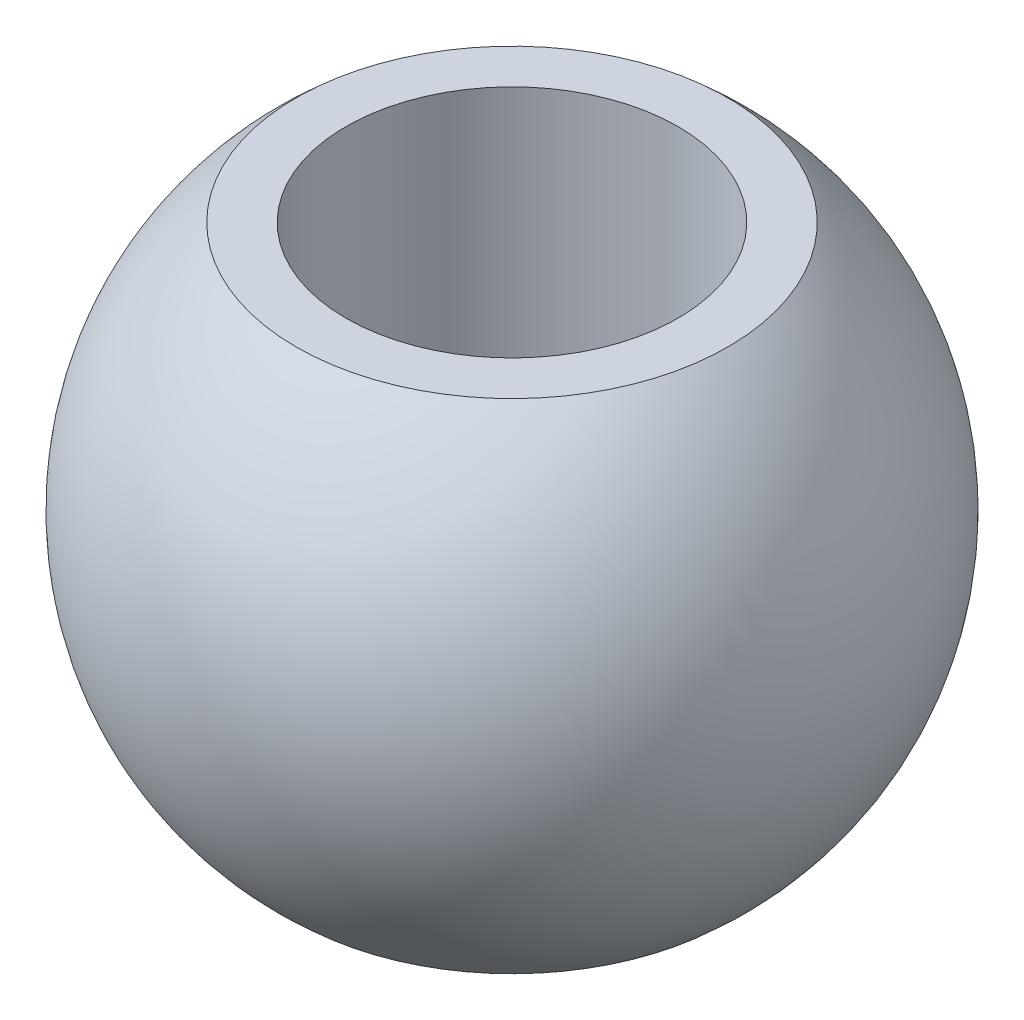
ISO-10303-21;
HEADER;
FILE_DESCRIPTION(('STEP AP214'),'2;1');
FILE_NAME('part.step','',(''),(''),'','','');
FILE_SCHEMA(('AUTOMOTIVE_DESIGN { 1 0 10303 214 1 1 1 1 }'));
ENDSEC;
DATA;
#1=APPLICATION_CONTEXT('core data for automotive mechanical design processes');
#2=APPLICATION_PROTOCOL_DEFINITION('international standard','automotive_design',2000,#1);
#3=PRODUCT_CONTEXT('',#1,'mechanical');
#4=PRODUCT('Part','Part','',(#3));
#5=PRODUCT_RELATED_PRODUCT_CATEGORY('part','',(#4));
#6=PRODUCT_DEFINITION_FORMATION('','',#4);
#7=PRODUCT_DEFINITION_CONTEXT('part definition',#1,'design');
#8=PRODUCT_DEFINITION('design','',#6,#7);
#9=PRODUCT_DEFINITION_SHAPE('','',#8);
#10=(LENGTH_UNIT() NAMED_UNIT(*) SI_UNIT(.MILLI.,.METRE.));
#11=(NAMED_UNIT(*) PLANE_ANGLE_UNIT() SI_UNIT($,.RADIAN.));
#12=(NAMED_UNIT(*) SI_UNIT($,.STERADIAN.) SOLID_ANGLE_UNIT());
#13=UNCERTAINTY_MEASURE_WITH_UNIT(LENGTH_MEASURE(1.E-05),#10,'distance_accuracy_value','');
#14=(GEOMETRIC_REPRESENTATION_CONTEXT(3) GLOBAL_UNCERTAINTY_ASSIGNED_CONTEXT((#13)) GLOBAL_UNIT_ASSIGNED_CONTEXT((#10,
#11,#12)) REPRESENTATION_CONTEXT('',''));
#15=CARTESIAN_POINT('',(0.,0.,0.));
#16=DIRECTION('',(0.,0.,1.));
#17=DIRECTION('',(1.,0.,0.));
#18=AXIS2_PLACEMENT_3D('',#15,#16,#17);
#19=CARTESIAN_POINT('',(0.,6.,0.));
#20=DIRECTION('',(0.,1.,0.));
#21=DIRECTION('',(0.,0.,1.));
#22=AXIS2_PLACEMENT_3D('',#19,#20,#21);
#23=DEGENERATE_TOROIDAL_SURFACE('',#22,0.00347171180604521,7.9375,.T.);
#24=CARTESIAN_POINT('',(0.,0.,0.));
#25=DIRECTION('',(0.,1.,0.));
#26=DIRECTION('',(0.,0.,1.));
#27=AXIS2_PLACEMENT_3D('',#24,#25,#26);
#28=CIRCLE('',#27,5.2);
#29=CARTESIAN_POINT('',(0.,0.,5.2));
#30=VERTEX_POINT('',#29);
#31=EDGE_CURVE('E10',#30,#30,#28,.T.);
#32=ORIENTED_EDGE('',*,*,#31,.T.);
#33=EDGE_LOOP('',(#32));
#34=FACE_BOUND('',#33,.T.);
#35=CARTESIAN_POINT('',(0.,12.,0.));
#36=DIRECTION('',(0.,1.,0.));
#37=DIRECTION('',(0.,0.,1.));
#38=AXIS2_PLACEMENT_3D('',#35,#36,#37);
#39=CIRCLE('',#38,5.2);
#40=CARTESIAN_POINT('',(0.,12.,5.2));
#41=VERTEX_POINT('',#40);
#42=EDGE_CURVE('E44',#41,#41,#39,.T.);
#43=ORIENTED_EDGE('',*,*,#42,.F.);
#44=EDGE_LOOP('',(#43));
#45=FACE_BOUND('',#44,.T.);
#46=ADVANCED_FACE('F30',(#34,#45),#23,.T.);
#47=CARTESIAN_POINT('',(-4.,0.,0.));
#48=DIRECTION('',(0.,-1.,0.));
#49=DIRECTION('',(0.,0.,-1.));
#50=AXIS2_PLACEMENT_3D('',#47,#48,#49);
#51=PLANE('',#50);
#52=CARTESIAN_POINT('',(0.,0.,0.));
#53=DIRECTION('',(0.,1.,0.));
#54=DIRECTION('',(0.,0.,1.));
#55=AXIS2_PLACEMENT_3D('',#52,#53,#54);
#56=CIRCLE('',#55,4.);
#57=CARTESIAN_POINT('',(0.,0.,4.));
#58=VERTEX_POINT('',#57);
#59=EDGE_CURVE('E36',#58,#58,#56,.T.);
#60=ORIENTED_EDGE('',*,*,#59,.T.);
#61=EDGE_LOOP('',(#60));
#62=FACE_BOUND('',#61,.T.);
#63=ORIENTED_EDGE('',*,*,#31,.F.);
#64=EDGE_LOOP('',(#63));
#65=FACE_BOUND('',#64,.T.);
#66=ADVANCED_FACE('F54',(#62,#65),#51,.T.);
#67=CARTESIAN_POINT('',(0.,12.,0.));
#68=DIRECTION('',(0.,1.,0.));
#69=DIRECTION('',(0.,0.,1.));
#70=AXIS2_PLACEMENT_3D('',#67,#68,#69);
#71=CYLINDRICAL_SURFACE('',#70,4.);
#72=CARTESIAN_POINT('',(0.,12.,0.));
#73=DIRECTION('',(0.,1.,0.));
#74=DIRECTION('',(0.,0.,1.));
#75=AXIS2_PLACEMENT_3D('',#72,#73,#74);
#76=CIRCLE('',#75,4.);
#77=CARTESIAN_POINT('',(0.,12.,4.));
#78=VERTEX_POINT('',#77);
#79=EDGE_CURVE('E40',#78,#78,#76,.T.);
#80=ORIENTED_EDGE('',*,*,#79,.T.);
#81=EDGE_LOOP('',(#80));
#82=FACE_BOUND('',#81,.T.);
#83=ORIENTED_EDGE('',*,*,#59,.F.);
#84=EDGE_LOOP('',(#83));
#85=FACE_BOUND('',#84,.T.);
#86=ADVANCED_FACE('F58',(#82,#85),#71,.F.);
#87=CARTESIAN_POINT('',(-5.2,12.,0.));
#88=DIRECTION('',(0.,1.,0.));
#89=DIRECTION('',(0.,0.,1.));
#90=AXIS2_PLACEMENT_3D('',#87,#88,#89);
#91=PLANE('',#90);
#92=ORIENTED_EDGE('',*,*,#42,.T.);
#93=EDGE_LOOP('',(#92));
#94=FACE_BOUND('',#93,.T.);
#95=ORIENTED_EDGE('',*,*,#79,.F.);
#96=EDGE_LOOP('',(#95));
#97=FACE_BOUND('',#96,.T.);
#98=ADVANCED_FACE('F50',(#94,#97),#91,.T.);
#99=CLOSED_SHELL('',(#46,#66,#86,#98));
#100=MANIFOLD_SOLID_BREP('B2',#99);
#101=ADVANCED_BREP_SHAPE_REPRESENTATION('',(#18,#100),#14);
#102=SHAPE_DEFINITION_REPRESENTATION(#9,#101);
ENDSEC;
END-ISO-10303-21;
